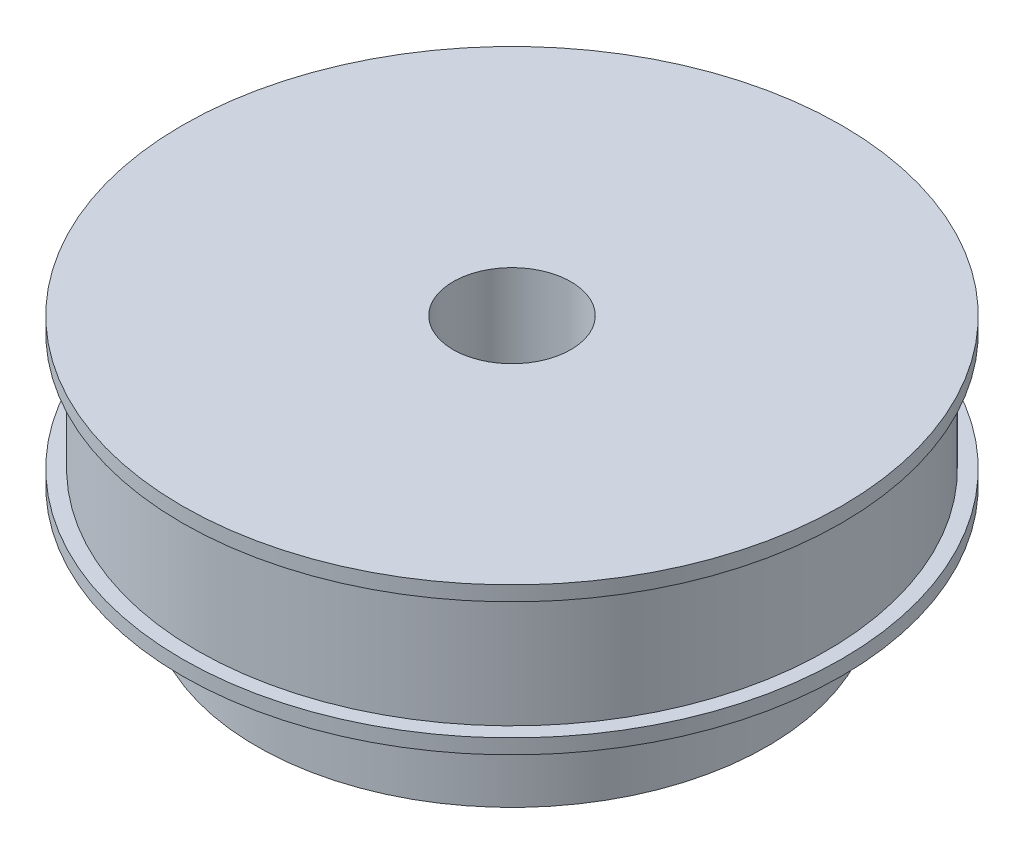
ISO-10303-21;
HEADER;
FILE_DESCRIPTION(('STEP AP214'),'2;1');
FILE_NAME('part.step','',(''),(''),'','','');
FILE_SCHEMA(('AUTOMOTIVE_DESIGN { 1 0 10303 214 1 1 1 1 }'));
ENDSEC;
DATA;
#1=APPLICATION_CONTEXT('core data for automotive mechanical design processes');
#2=APPLICATION_PROTOCOL_DEFINITION('international standard','automotive_design',2000,#1);
#3=PRODUCT_CONTEXT('',#1,'mechanical');
#4=PRODUCT('Part','Part','',(#3));
#5=PRODUCT_RELATED_PRODUCT_CATEGORY('part','',(#4));
#6=PRODUCT_DEFINITION_FORMATION('','',#4);
#7=PRODUCT_DEFINITION_CONTEXT('part definition',#1,'design');
#8=PRODUCT_DEFINITION('design','',#6,#7);
#9=PRODUCT_DEFINITION_SHAPE('','',#8);
#10=(LENGTH_UNIT() NAMED_UNIT(*) SI_UNIT(.MILLI.,.METRE.));
#11=(NAMED_UNIT(*) PLANE_ANGLE_UNIT() SI_UNIT($,.RADIAN.));
#12=(NAMED_UNIT(*) SI_UNIT($,.STERADIAN.) SOLID_ANGLE_UNIT());
#13=UNCERTAINTY_MEASURE_WITH_UNIT(LENGTH_MEASURE(1.E-05),#10,'distance_accuracy_value','');
#14=(GEOMETRIC_REPRESENTATION_CONTEXT(3) GLOBAL_UNCERTAINTY_ASSIGNED_CONTEXT((#13)) GLOBAL_UNIT_ASSIGNED_CONTEXT((#10,
#11,#12)) REPRESENTATION_CONTEXT('',''));
#15=CARTESIAN_POINT('',(0.,0.,0.));
#16=DIRECTION('',(0.,0.,1.));
#17=DIRECTION('',(1.,0.,0.));
#18=AXIS2_PLACEMENT_3D('',#15,#16,#17);
#19=CARTESIAN_POINT('',(0.,12.,0.));
#20=DIRECTION('',(0.,-1.,0.));
#21=DIRECTION('',(0.,0.,-1.));
#22=AXIS2_PLACEMENT_3D('',#19,#20,#21);
#23=CYLINDRICAL_SURFACE('',#22,32.085);
#24=CARTESIAN_POINT('',(0.,12.,0.));
#25=DIRECTION('',(0.,1.,0.));
#26=DIRECTION('',(0.,0.,1.));
#27=AXIS2_PLACEMENT_3D('',#24,#25,#26);
#28=CIRCLE('',#27,32.085);
#29=CARTESIAN_POINT('',(0.,12.,32.085));
#30=VERTEX_POINT('',#29);
#31=EDGE_CURVE('E45',#30,#30,#28,.T.);
#32=ORIENTED_EDGE('',*,*,#31,.F.);
#33=EDGE_LOOP('',(#32));
#34=FACE_BOUND('',#33,.T.);
#35=CARTESIAN_POINT('',(0.,0.,0.));
#36=DIRECTION('',(0.,1.,0.));
#37=DIRECTION('',(0.,0.,1.));
#38=AXIS2_PLACEMENT_3D('',#35,#36,#37);
#39=CIRCLE('',#38,32.085);
#40=CARTESIAN_POINT('',(0.,0.,32.085));
#41=VERTEX_POINT('',#40);
#42=EDGE_CURVE('E40',#41,#41,#39,.T.);
#43=ORIENTED_EDGE('',*,*,#42,.T.);
#44=EDGE_LOOP('',(#43));
#45=FACE_BOUND('',#44,.T.);
#46=ADVANCED_FACE('F37',(#34,#45),#23,.T.);
#47=CARTESIAN_POINT('',(0.,13.5,0.));
#48=DIRECTION('',(0.,-1.,0.));
#49=DIRECTION('',(0.,0.,-1.));
#50=AXIS2_PLACEMENT_3D('',#47,#48,#49);
#51=CYLINDRICAL_SURFACE('',#50,33.585);
#52=CARTESIAN_POINT('',(0.,13.5,0.));
#53=DIRECTION('',(0.,1.,0.));
#54=DIRECTION('',(0.,0.,1.));
#55=AXIS2_PLACEMENT_3D('',#52,#53,#54);
#56=CIRCLE('',#55,33.585);
#57=CARTESIAN_POINT('',(0.,13.5,33.585));
#58=VERTEX_POINT('',#57);
#59=EDGE_CURVE('E51',#58,#58,#56,.T.);
#60=ORIENTED_EDGE('',*,*,#59,.F.);
#61=EDGE_LOOP('',(#60));
#62=FACE_BOUND('',#61,.T.);
#63=CARTESIAN_POINT('',(0.,12.,0.));
#64=DIRECTION('',(0.,1.,0.));
#65=DIRECTION('',(0.,0.,1.));
#66=AXIS2_PLACEMENT_3D('',#63,#64,#65);
#67=CIRCLE('',#66,33.585);
#68=CARTESIAN_POINT('',(0.,12.,33.585));
#69=VERTEX_POINT('',#68);
#70=EDGE_CURVE('E67',#69,#69,#67,.T.);
#71=ORIENTED_EDGE('',*,*,#70,.T.);
#72=EDGE_LOOP('',(#71));
#73=FACE_BOUND('',#72,.T.);
#74=ADVANCED_FACE('F102',(#62,#73),#51,.T.);
#75=CARTESIAN_POINT('',(0.,13.5,0.));
#76=DIRECTION('',(0.,1.,0.));
#77=DIRECTION('',(0.,0.,1.));
#78=AXIS2_PLACEMENT_3D('',#75,#76,#77);
#79=PLANE('',#78);
#80=CARTESIAN_POINT('',(0.,13.5,0.));
#81=DIRECTION('',(0.,1.,0.));
#82=DIRECTION('',(0.,0.,1.));
#83=AXIS2_PLACEMENT_3D('',#80,#81,#82);
#84=CIRCLE('',#83,6.);
#85=CARTESIAN_POINT('',(0.,13.5,6.));
#86=VERTEX_POINT('',#85);
#87=EDGE_CURVE('E120',#86,#86,#84,.T.);
#88=ORIENTED_EDGE('',*,*,#87,.F.);
#89=EDGE_LOOP('',(#88));
#90=FACE_BOUND('',#89,.T.);
#91=ORIENTED_EDGE('',*,*,#59,.T.);
#92=EDGE_LOOP('',(#91));
#93=FACE_BOUND('',#92,.T.);
#94=ADVANCED_FACE('F96',(#90,#93),#79,.T.);
#95=CARTESIAN_POINT('',(0.,12.,0.));
#96=DIRECTION('',(0.,1.,0.));
#97=DIRECTION('',(0.,0.,1.));
#98=AXIS2_PLACEMENT_3D('',#95,#96,#97);
#99=PLANE('',#98);
#100=ORIENTED_EDGE('',*,*,#31,.T.);
#101=EDGE_LOOP('',(#100));
#102=FACE_BOUND('',#101,.T.);
#103=ORIENTED_EDGE('',*,*,#70,.F.);
#104=EDGE_LOOP('',(#103));
#105=FACE_BOUND('',#104,.T.);
#106=ADVANCED_FACE('F87',(#102,#105),#99,.F.);
#107=CARTESIAN_POINT('',(0.,-1.5,0.));
#108=DIRECTION('',(0.,1.,0.));
#109=DIRECTION('',(0.,0.,1.));
#110=AXIS2_PLACEMENT_3D('',#107,#108,#109);
#111=CYLINDRICAL_SURFACE('',#110,33.585);
#112=CARTESIAN_POINT('',(0.,-1.5,0.));
#113=DIRECTION('',(0.,-1.,0.));
#114=DIRECTION('',(0.,0.,-1.));
#115=AXIS2_PLACEMENT_3D('',#112,#113,#114);
#116=CIRCLE('',#115,33.585);
#117=CARTESIAN_POINT('',(0.,-1.5,-33.585));
#118=VERTEX_POINT('',#117);
#119=EDGE_CURVE('E56',#118,#118,#116,.T.);
#120=ORIENTED_EDGE('',*,*,#119,.F.);
#121=EDGE_LOOP('',(#120));
#122=FACE_BOUND('',#121,.T.);
#123=CARTESIAN_POINT('',(0.,0.,0.));
#124=DIRECTION('',(0.,-1.,0.));
#125=DIRECTION('',(0.,0.,-1.));
#126=AXIS2_PLACEMENT_3D('',#123,#124,#125);
#127=CIRCLE('',#126,33.585);
#128=CARTESIAN_POINT('',(0.,0.,-33.585));
#129=VERTEX_POINT('',#128);
#130=EDGE_CURVE('E60',#129,#129,#127,.T.);
#131=ORIENTED_EDGE('',*,*,#130,.T.);
#132=EDGE_LOOP('',(#131));
#133=FACE_BOUND('',#132,.T.);
#134=ADVANCED_FACE('F85',(#122,#133),#111,.T.);
#135=CARTESIAN_POINT('',(0.,-1.5,0.));
#136=DIRECTION('',(0.,-1.,0.));
#137=DIRECTION('',(0.,0.,-1.));
#138=AXIS2_PLACEMENT_3D('',#135,#136,#137);
#139=PLANE('',#138);
#140=CARTESIAN_POINT('',(0.,-1.5,0.));
#141=DIRECTION('',(0.,-1.,0.));
#142=DIRECTION('',(0.,0.,-1.));
#143=AXIS2_PLACEMENT_3D('',#140,#141,#142);
#144=CIRCLE('',#143,26.);
#145=CARTESIAN_POINT('',(0.,-1.5,-26.));
#146=VERTEX_POINT('',#145);
#147=EDGE_CURVE('E10',#146,#146,#144,.T.);
#148=ORIENTED_EDGE('',*,*,#147,.F.);
#149=EDGE_LOOP('',(#148));
#150=FACE_BOUND('',#149,.T.);
#151=ORIENTED_EDGE('',*,*,#119,.T.);
#152=EDGE_LOOP('',(#151));
#153=FACE_BOUND('',#152,.T.);
#154=ADVANCED_FACE('F81',(#150,#153),#139,.T.);
#155=CARTESIAN_POINT('',(0.,0.,0.));
#156=DIRECTION('',(0.,-1.,0.));
#157=DIRECTION('',(0.,0.,-1.));
#158=AXIS2_PLACEMENT_3D('',#155,#156,#157);
#159=PLANE('',#158);
#160=ORIENTED_EDGE('',*,*,#42,.F.);
#161=EDGE_LOOP('',(#160));
#162=FACE_BOUND('',#161,.T.);
#163=ORIENTED_EDGE('',*,*,#130,.F.);
#164=EDGE_LOOP('',(#163));
#165=FACE_BOUND('',#164,.T.);
#166=ADVANCED_FACE('F77',(#162,#165),#159,.F.);
#167=CARTESIAN_POINT('',(0.,-11.5,0.));
#168=DIRECTION('',(0.,1.,0.));
#169=DIRECTION('',(0.,0.,1.));
#170=AXIS2_PLACEMENT_3D('',#167,#168,#169);
#171=CYLINDRICAL_SURFACE('',#170,26.);
#172=CARTESIAN_POINT('',(0.,-11.5,0.));
#173=DIRECTION('',(0.,-1.,0.));
#174=DIRECTION('',(0.,0.,-1.));
#175=AXIS2_PLACEMENT_3D('',#172,#173,#174);
#176=CIRCLE('',#175,26.);
#177=CARTESIAN_POINT('',(0.,-11.5,-26.));
#178=VERTEX_POINT('',#177);
#179=EDGE_CURVE('E54',#178,#178,#176,.T.);
#180=ORIENTED_EDGE('',*,*,#179,.F.);
#181=EDGE_LOOP('',(#180));
#182=FACE_BOUND('',#181,.T.);
#183=ORIENTED_EDGE('',*,*,#147,.T.);
#184=EDGE_LOOP('',(#183));
#185=FACE_BOUND('',#184,.T.);
#186=ADVANCED_FACE('F80',(#182,#185),#171,.T.);
#187=CARTESIAN_POINT('',(0.,-11.5,0.));
#188=DIRECTION('',(0.,-1.,0.));
#189=DIRECTION('',(0.,0.,-1.));
#190=AXIS2_PLACEMENT_3D('',#187,#188,#189);
#191=PLANE('',#190);
#192=CARTESIAN_POINT('',(0.,-11.5,0.));
#193=DIRECTION('',(0.,-1.,0.));
#194=DIRECTION('',(0.,0.,-1.));
#195=AXIS2_PLACEMENT_3D('',#192,#193,#194);
#196=CIRCLE('',#195,6.);
#197=CARTESIAN_POINT('',(0.,-11.5,-6.));
#198=VERTEX_POINT('',#197);
#199=EDGE_CURVE('E123',#198,#198,#196,.F.);
#200=ORIENTED_EDGE('',*,*,#199,.T.);
#201=EDGE_LOOP('',(#200));
#202=FACE_BOUND('',#201,.T.);
#203=ORIENTED_EDGE('',*,*,#179,.T.);
#204=EDGE_LOOP('',(#203));
#205=FACE_BOUND('',#204,.T.);
#206=ADVANCED_FACE('F133',(#202,#205),#191,.T.);
#207=CARTESIAN_POINT('',(0.,-28.4705627484771,0.));
#208=DIRECTION('',(0.,1.,0.));
#209=DIRECTION('',(0.,0.,1.));
#210=AXIS2_PLACEMENT_3D('',#207,#208,#209);
#211=CYLINDRICAL_SURFACE('',#210,6.);
#212=ORIENTED_EDGE('',*,*,#87,.T.);
#213=EDGE_LOOP('',(#212));
#214=FACE_BOUND('',#213,.T.);
#215=ORIENTED_EDGE('',*,*,#199,.F.);
#216=EDGE_LOOP('',(#215));
#217=FACE_BOUND('',#216,.T.);
#218=ADVANCED_FACE('F140',(#214,#217),#211,.F.);
#219=CLOSED_SHELL('',(#46,#74,#94,#106,#134,#154,#166,#186,#206,#218));
#220=MANIFOLD_SOLID_BREP('B2',#219);
#221=ADVANCED_BREP_SHAPE_REPRESENTATION('',(#18,#220),#14);
#222=SHAPE_DEFINITION_REPRESENTATION(#9,#221);
ENDSEC;
END-ISO-10303-21;
